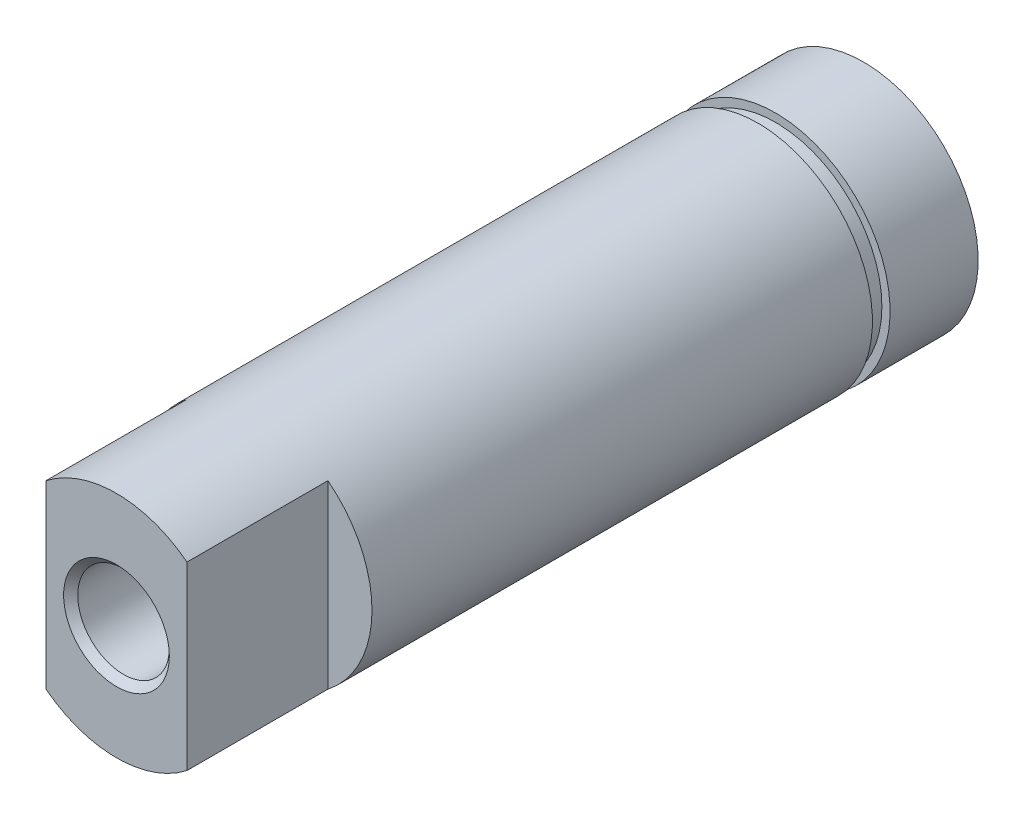
ISO-10303-21;
HEADER;
FILE_DESCRIPTION(('STEP AP214'),'2;1');
FILE_NAME('part.step','',(''),(''),'','','');
FILE_SCHEMA(('AUTOMOTIVE_DESIGN { 1 0 10303 214 1 1 1 1 }'));
ENDSEC;
DATA;
#1=APPLICATION_CONTEXT('core data for automotive mechanical design processes');
#2=APPLICATION_PROTOCOL_DEFINITION('international standard','automotive_design',2000,#1);
#3=PRODUCT_CONTEXT('',#1,'mechanical');
#4=PRODUCT('Part','Part','',(#3));
#5=PRODUCT_RELATED_PRODUCT_CATEGORY('part','',(#4));
#6=PRODUCT_DEFINITION_FORMATION('','',#4);
#7=PRODUCT_DEFINITION_CONTEXT('part definition',#1,'design');
#8=PRODUCT_DEFINITION('design','',#6,#7);
#9=PRODUCT_DEFINITION_SHAPE('','',#8);
#10=(LENGTH_UNIT() NAMED_UNIT(*) SI_UNIT(.MILLI.,.METRE.));
#11=(NAMED_UNIT(*) PLANE_ANGLE_UNIT() SI_UNIT($,.RADIAN.));
#12=(NAMED_UNIT(*) SI_UNIT($,.STERADIAN.) SOLID_ANGLE_UNIT());
#13=UNCERTAINTY_MEASURE_WITH_UNIT(LENGTH_MEASURE(1.E-05),#10,'distance_accuracy_value','');
#14=(GEOMETRIC_REPRESENTATION_CONTEXT(3) GLOBAL_UNCERTAINTY_ASSIGNED_CONTEXT((#13)) GLOBAL_UNIT_ASSIGNED_CONTEXT((#10,
#11,#12)) REPRESENTATION_CONTEXT('',''));
#15=CARTESIAN_POINT('',(0.,0.,0.));
#16=DIRECTION('',(0.,0.,1.));
#17=DIRECTION('',(1.,0.,0.));
#18=AXIS2_PLACEMENT_3D('',#15,#16,#17);
#19=CARTESIAN_POINT('',(0.,0.,6.2));
#20=DIRECTION('',(0.,0.,1.));
#21=DIRECTION('',(1.,0.,0.));
#22=AXIS2_PLACEMENT_3D('',#19,#20,#21);
#23=PLANE('',#22);
#24=CARTESIAN_POINT('',(0.,0.,6.2));
#25=DIRECTION('',(0.,0.,1.));
#26=DIRECTION('',(1.,0.,0.));
#27=AXIS2_PLACEMENT_3D('',#24,#25,#26);
#28=CIRCLE('',#27,1.3);
#29=CARTESIAN_POINT('',(1.3,0.,6.2));
#30=VERTEX_POINT('',#29);
#31=EDGE_CURVE('E20',#30,#30,#28,.F.);
#32=ORIENTED_EDGE('',*,*,#31,.F.);
#33=EDGE_LOOP('',(#32));
#34=FACE_BOUND('',#33,.T.);
#35=ADVANCED_FACE('F17',(#34),#23,.T.);
#36=CARTESIAN_POINT('',(0.,0.,6.2));
#37=DIRECTION('',(0.,0.,1.));
#38=DIRECTION('',(1.,0.,0.));
#39=AXIS2_PLACEMENT_3D('',#36,#37,#38);
#40=CYLINDRICAL_SURFACE('',#39,1.3);
#41=ORIENTED_EDGE('',*,*,#31,.T.);
#42=EDGE_LOOP('',(#41));
#43=FACE_BOUND('',#42,.T.);
#44=CARTESIAN_POINT('',(0.,0.,21.));
#45=DIRECTION('',(0.,0.,1.));
#46=DIRECTION('',(1.,0.,0.));
#47=AXIS2_PLACEMENT_3D('',#44,#45,#46);
#48=CIRCLE('',#47,1.3);
#49=CARTESIAN_POINT('',(1.3,0.,21.));
#50=VERTEX_POINT('',#49);
#51=EDGE_CURVE('E94',#50,#50,#48,.F.);
#52=ORIENTED_EDGE('',*,*,#51,.F.);
#53=EDGE_LOOP('',(#52));
#54=FACE_BOUND('',#53,.T.);
#55=ADVANCED_FACE('F233',(#43,#54),#40,.F.);
#56=CARTESIAN_POINT('',(0.,0.,21.));
#57=DIRECTION('',(0.,0.,1.));
#58=DIRECTION('',(1.,0.,0.));
#59=AXIS2_PLACEMENT_3D('',#56,#57,#58);
#60=CONICAL_SURFACE('',#59,1.3,0.785398163397451);
#61=ORIENTED_EDGE('',*,*,#51,.T.);
#62=EDGE_LOOP('',(#61));
#63=FACE_BOUND('',#62,.T.);
#64=CARTESIAN_POINT('',(0.,0.,21.2));
#65=DIRECTION('',(0.,0.,1.));
#66=DIRECTION('',(1.,0.,0.));
#67=AXIS2_PLACEMENT_3D('',#64,#65,#66);
#68=CIRCLE('',#67,1.5);
#69=CARTESIAN_POINT('',(1.5,0.,21.2));
#70=VERTEX_POINT('',#69);
#71=EDGE_CURVE('E63',#70,#70,#68,.F.);
#72=ORIENTED_EDGE('',*,*,#71,.F.);
#73=EDGE_LOOP('',(#72));
#74=FACE_BOUND('',#73,.T.);
#75=ADVANCED_FACE('F225',(#63,#74),#60,.F.);
#76=CARTESIAN_POINT('',(0.,0.,17.2));
#77=DIRECTION('',(0.,0.,-1.));
#78=DIRECTION('',(-1.,0.,0.));
#79=AXIS2_PLACEMENT_3D('',#76,#77,#78);
#80=PLANE('',#79);
#81=DIRECTION('',(0.,1.,0.));
#82=VECTOR('',#81,1.);
#83=CARTESIAN_POINT('',(2.,2.808702216,17.2));
#84=LINE('',#83,#82);
#85=CARTESIAN_POINT('',(2.00000000011882,-2.56173769139714,17.2));
#86=VERTEX_POINT('',#85);
#87=CARTESIAN_POINT('',(2.00000000011882,2.56173769139714,17.2));
#88=VERTEX_POINT('',#87);
#89=EDGE_CURVE('E79',#86,#88,#84,.T.);
#90=ORIENTED_EDGE('',*,*,#89,.F.);
#91=CARTESIAN_POINT('',(0.,0.,17.2));
#92=DIRECTION('',(0.,0.,-1.));
#93=DIRECTION('',(-1.,0.,0.));
#94=AXIS2_PLACEMENT_3D('',#91,#92,#93);
#95=CIRCLE('',#94,3.25);
#96=EDGE_CURVE('E72',#88,#86,#95,.T.);
#97=ORIENTED_EDGE('',*,*,#96,.F.);
#98=EDGE_LOOP('',(#90,#97));
#99=FACE_BOUND('',#98,.T.);
#100=ADVANCED_FACE('F114',(#99),#80,.F.);
#101=CARTESIAN_POINT('',(0.,0.,17.2));
#102=DIRECTION('',(0.,0.,-1.));
#103=DIRECTION('',(-1.,0.,0.));
#104=AXIS2_PLACEMENT_3D('',#101,#102,#103);
#105=PLANE('',#104);
#106=CARTESIAN_POINT('',(0.,0.,17.2));
#107=DIRECTION('',(0.,0.,-1.));
#108=DIRECTION('',(-1.,0.,0.));
#109=AXIS2_PLACEMENT_3D('',#106,#107,#108);
#110=CIRCLE('',#109,3.25);
#111=CARTESIAN_POINT('',(-2.00000000011882,-2.56173769139714,17.2));
#112=VERTEX_POINT('',#111);
#113=CARTESIAN_POINT('',(-2.00000000011882,2.56173769139714,17.2));
#114=VERTEX_POINT('',#113);
#115=EDGE_CURVE('E110',#112,#114,#110,.T.);
#116=ORIENTED_EDGE('',*,*,#115,.F.);
#117=DIRECTION('',(0.,1.,0.));
#118=VECTOR('',#117,1.);
#119=CARTESIAN_POINT('',(-2.,2.561737691,17.2));
#120=LINE('',#119,#118);
#121=EDGE_CURVE('E64',#114,#112,#120,.F.);
#122=ORIENTED_EDGE('',*,*,#121,.F.);
#123=EDGE_LOOP('',(#116,#122));
#124=FACE_BOUND('',#123,.T.);
#125=ADVANCED_FACE('F209',(#124),#105,.F.);
#126=CARTESIAN_POINT('',(-2.,2.561737691,17.2));
#127=DIRECTION('',(1.,0.,0.));
#128=DIRECTION('',(0.,0.,-1.));
#129=AXIS2_PLACEMENT_3D('',#126,#127,#128);
#130=PLANE('',#129);
#131=ORIENTED_EDGE('',*,*,#121,.T.);
#132=DIRECTION('',(0.,0.,-1.));
#133=VECTOR('',#132,1.);
#134=CARTESIAN_POINT('',(-2.00000000023763,-2.56173769130438,12.1));
#135=LINE('',#134,#133);
#136=CARTESIAN_POINT('',(-2.00000000011882,-2.56173769139714,21.2));
#137=VERTEX_POINT('',#136);
#138=EDGE_CURVE('E68',#137,#112,#135,.T.);
#139=ORIENTED_EDGE('',*,*,#138,.F.);
#140=DIRECTION('',(0.,1.,0.));
#141=VECTOR('',#140,1.);
#142=CARTESIAN_POINT('',(-2.,0.,21.2));
#143=LINE('',#142,#141);
#144=CARTESIAN_POINT('',(-2.00000000011882,2.56173769139714,21.2));
#145=VERTEX_POINT('',#144);
#146=EDGE_CURVE('E52',#145,#137,#143,.F.);
#147=ORIENTED_EDGE('',*,*,#146,.F.);
#148=DIRECTION('',(0.,0.,1.));
#149=VECTOR('',#148,1.);
#150=CARTESIAN_POINT('',(-2.00000000023763,2.56173769130438,12.1));
#151=LINE('',#150,#149);
#152=EDGE_CURVE('E109',#114,#145,#151,.T.);
#153=ORIENTED_EDGE('',*,*,#152,.F.);
#154=EDGE_LOOP('',(#131,#139,#147,#153));
#155=FACE_BOUND('',#154,.T.);
#156=ADVANCED_FACE('F69',(#155),#130,.F.);
#157=CARTESIAN_POINT('',(0.,0.,21.2));
#158=DIRECTION('',(0.,0.,1.));
#159=DIRECTION('',(1.,0.,0.));
#160=AXIS2_PLACEMENT_3D('',#157,#158,#159);
#161=PLANE('',#160);
#162=ORIENTED_EDGE('',*,*,#71,.T.);
#163=EDGE_LOOP('',(#162));
#164=FACE_BOUND('',#163,.T.);
#165=ORIENTED_EDGE('',*,*,#146,.T.);
#166=CARTESIAN_POINT('',(0.,0.,21.2));
#167=DIRECTION('',(0.,0.,-1.));
#168=DIRECTION('',(-1.,0.,0.));
#169=AXIS2_PLACEMENT_3D('',#166,#167,#168);
#170=CIRCLE('',#169,3.25);
#171=CARTESIAN_POINT('',(2.00000000011882,-2.56173769139714,21.2));
#172=VERTEX_POINT('',#171);
#173=EDGE_CURVE('E56',#172,#137,#170,.T.);
#174=ORIENTED_EDGE('',*,*,#173,.F.);
#175=DIRECTION('',(0.,1.,0.));
#176=VECTOR('',#175,1.);
#177=CARTESIAN_POINT('',(2.,2.808702216,21.2));
#178=LINE('',#177,#176);
#179=CARTESIAN_POINT('',(2.00000000011882,2.56173769139714,21.2));
#180=VERTEX_POINT('',#179);
#181=EDGE_CURVE('E35',#180,#172,#178,.F.);
#182=ORIENTED_EDGE('',*,*,#181,.F.);
#183=CARTESIAN_POINT('',(0.,0.,21.2));
#184=DIRECTION('',(0.,0.,-1.));
#185=DIRECTION('',(-1.,0.,0.));
#186=AXIS2_PLACEMENT_3D('',#183,#184,#185);
#187=CIRCLE('',#186,3.25);
#188=EDGE_CURVE('E59',#145,#180,#187,.T.);
#189=ORIENTED_EDGE('',*,*,#188,.F.);
#190=EDGE_LOOP('',(#165,#174,#182,#189));
#191=FACE_BOUND('',#190,.T.);
#192=ADVANCED_FACE('F54',(#164,#191),#161,.T.);
#193=CARTESIAN_POINT('',(2.,2.808702216,17.2));
#194=DIRECTION('',(-1.,0.,0.));
#195=DIRECTION('',(0.,0.,1.));
#196=AXIS2_PLACEMENT_3D('',#193,#194,#195);
#197=PLANE('',#196);
#198=ORIENTED_EDGE('',*,*,#89,.T.);
#199=DIRECTION('',(0.,0.,-1.));
#200=VECTOR('',#199,1.);
#201=CARTESIAN_POINT('',(2.00000000023763,2.56173769130438,12.1));
#202=LINE('',#201,#200);
#203=EDGE_CURVE('E92',#180,#88,#202,.T.);
#204=ORIENTED_EDGE('',*,*,#203,.F.);
#205=ORIENTED_EDGE('',*,*,#181,.T.);
#206=DIRECTION('',(0.,0.,1.));
#207=VECTOR('',#206,1.);
#208=CARTESIAN_POINT('',(2.00000000023763,-2.56173769130438,12.1));
#209=LINE('',#208,#207);
#210=EDGE_CURVE('E77',#86,#172,#209,.T.);
#211=ORIENTED_EDGE('',*,*,#210,.F.);
#212=EDGE_LOOP('',(#198,#204,#205,#211));
#213=FACE_BOUND('',#212,.T.);
#214=ADVANCED_FACE('F115',(#213),#197,.F.);
#215=CARTESIAN_POINT('',(0.,0.,3.));
#216=DIRECTION('',(0.,0.,-1.));
#217=DIRECTION('',(-1.,0.,0.));
#218=AXIS2_PLACEMENT_3D('',#215,#216,#217);
#219=CYLINDRICAL_SURFACE('',#218,3.25);
#220=CARTESIAN_POINT('',(0.,0.,3.));
#221=DIRECTION('',(0.,0.,-1.));
#222=DIRECTION('',(-1.,0.,0.));
#223=AXIS2_PLACEMENT_3D('',#220,#221,#222);
#224=CIRCLE('',#223,3.25);
#225=CARTESIAN_POINT('',(-3.25,0.,3.));
#226=VERTEX_POINT('',#225);
#227=EDGE_CURVE('E106',#226,#226,#224,.T.);
#228=ORIENTED_EDGE('',*,*,#227,.F.);
#229=EDGE_LOOP('',(#228));
#230=FACE_BOUND('',#229,.T.);
#231=ORIENTED_EDGE('',*,*,#188,.T.);
#232=ORIENTED_EDGE('',*,*,#203,.T.);
#233=ORIENTED_EDGE('',*,*,#96,.T.);
#234=ORIENTED_EDGE('',*,*,#210,.T.);
#235=ORIENTED_EDGE('',*,*,#173,.T.);
#236=ORIENTED_EDGE('',*,*,#138,.T.);
#237=ORIENTED_EDGE('',*,*,#115,.T.);
#238=ORIENTED_EDGE('',*,*,#152,.T.);
#239=EDGE_LOOP('',(#231,#232,#233,#234,#235,#236,#237,#238));
#240=FACE_BOUND('',#239,.T.);
#241=ADVANCED_FACE('F74',(#230,#240),#219,.T.);
#242=CARTESIAN_POINT('',(0.,3.25,3.));
#243=DIRECTION('',(0.,0.,-1.));
#244=DIRECTION('',(-1.,0.,0.));
#245=AXIS2_PLACEMENT_3D('',#242,#243,#244);
#246=PLANE('',#245);
#247=CARTESIAN_POINT('',(0.,0.,3.));
#248=DIRECTION('',(0.,0.,1.));
#249=DIRECTION('',(1.,0.,0.));
#250=AXIS2_PLACEMENT_3D('',#247,#248,#249);
#251=CIRCLE('',#250,3.018225213);
#252=CARTESIAN_POINT('',(3.018225213,0.,3.));
#253=VERTEX_POINT('',#252);
#254=EDGE_CURVE('E103',#253,#253,#251,.F.);
#255=ORIENTED_EDGE('',*,*,#254,.F.);
#256=EDGE_LOOP('',(#255));
#257=FACE_BOUND('',#256,.T.);
#258=ORIENTED_EDGE('',*,*,#227,.T.);
#259=EDGE_LOOP('',(#258));
#260=FACE_BOUND('',#259,.T.);
#261=ADVANCED_FACE('F123',(#257,#260),#246,.T.);
#262=CARTESIAN_POINT('',(0.,0.,3.));
#263=DIRECTION('',(0.,0.,1.));
#264=DIRECTION('',(1.,0.,0.));
#265=AXIS2_PLACEMENT_3D('',#262,#263,#264);
#266=CYLINDRICAL_SURFACE('',#265,3.018225213);
#267=CARTESIAN_POINT('',(0.,0.,2.5));
#268=DIRECTION('',(0.,0.,1.));
#269=DIRECTION('',(1.,0.,0.));
#270=AXIS2_PLACEMENT_3D('',#267,#268,#269);
#271=CIRCLE('',#270,3.018225213);
#272=CARTESIAN_POINT('',(3.018225213,0.,2.5));
#273=VERTEX_POINT('',#272);
#274=EDGE_CURVE('E100',#273,#273,#271,.F.);
#275=ORIENTED_EDGE('',*,*,#274,.F.);
#276=EDGE_LOOP('',(#275));
#277=FACE_BOUND('',#276,.T.);
#278=ORIENTED_EDGE('',*,*,#254,.T.);
#279=EDGE_LOOP('',(#278));
#280=FACE_BOUND('',#279,.T.);
#281=ADVANCED_FACE('F142',(#277,#280),#266,.T.);
#282=CARTESIAN_POINT('',(0.,3.25,2.5));
#283=DIRECTION('',(0.,0.,1.));
#284=DIRECTION('',(1.,0.,0.));
#285=AXIS2_PLACEMENT_3D('',#282,#283,#284);
#286=PLANE('',#285);
#287=ORIENTED_EDGE('',*,*,#274,.T.);
#288=EDGE_LOOP('',(#287));
#289=FACE_BOUND('',#288,.T.);
#290=CARTESIAN_POINT('',(0.,0.,2.5));
#291=DIRECTION('',(0.,0.,-1.));
#292=DIRECTION('',(-1.,0.,0.));
#293=AXIS2_PLACEMENT_3D('',#290,#291,#292);
#294=CIRCLE('',#293,3.25);
#295=CARTESIAN_POINT('',(-3.25,0.,2.5));
#296=VERTEX_POINT('',#295);
#297=EDGE_CURVE('E26',#296,#296,#294,.T.);
#298=ORIENTED_EDGE('',*,*,#297,.F.);
#299=EDGE_LOOP('',(#298));
#300=FACE_BOUND('',#299,.T.);
#301=ADVANCED_FACE('F135',(#289,#300),#286,.T.);
#302=CARTESIAN_POINT('',(0.,0.,0.));
#303=DIRECTION('',(0.,0.,1.));
#304=DIRECTION('',(1.,0.,0.));
#305=AXIS2_PLACEMENT_3D('',#302,#303,#304);
#306=PLANE('',#305);
#307=CARTESIAN_POINT('',(0.,0.,0.));
#308=DIRECTION('',(0.,0.,-1.));
#309=DIRECTION('',(-1.,0.,0.));
#310=AXIS2_PLACEMENT_3D('',#307,#308,#309);
#311=CIRCLE('',#310,3.25);
#312=CARTESIAN_POINT('',(-3.25,0.,0.));
#313=VERTEX_POINT('',#312);
#314=EDGE_CURVE('E11',#313,#313,#311,.F.);
#315=ORIENTED_EDGE('',*,*,#314,.F.);
#316=EDGE_LOOP('',(#315));
#317=FACE_BOUND('',#316,.T.);
#318=ADVANCED_FACE('F129',(#317),#306,.F.);
#319=CARTESIAN_POINT('',(0.,0.,0.));
#320=DIRECTION('',(0.,0.,-1.));
#321=DIRECTION('',(-1.,0.,0.));
#322=AXIS2_PLACEMENT_3D('',#319,#320,#321);
#323=CYLINDRICAL_SURFACE('',#322,3.25);
#324=ORIENTED_EDGE('',*,*,#314,.T.);
#325=EDGE_LOOP('',(#324));
#326=FACE_BOUND('',#325,.T.);
#327=ORIENTED_EDGE('',*,*,#297,.T.);
#328=EDGE_LOOP('',(#327));
#329=FACE_BOUND('',#328,.T.);
#330=ADVANCED_FACE('F127',(#326,#329),#323,.T.);
#331=CLOSED_SHELL('',(#35,#55,#75,#100,#125,#156,#192,#214,#241,#261,#281,#301,#318,#330));
#332=MANIFOLD_SOLID_BREP('B1',#331);
#333=ADVANCED_BREP_SHAPE_REPRESENTATION('',(#18,#332),#14);
#334=SHAPE_DEFINITION_REPRESENTATION(#9,#333);
ENDSEC;
END-ISO-10303-21;
